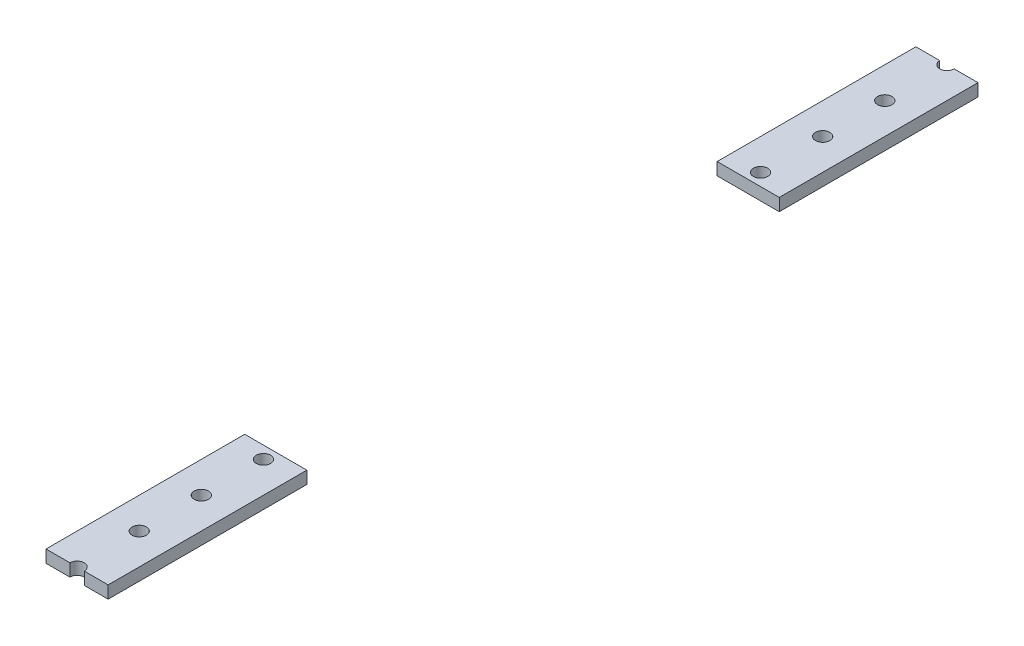
ISO-10303-21;
HEADER;
FILE_DESCRIPTION(('STEP AP214'),'2;1');
FILE_NAME('part.step','',(''),(''),'','','');
FILE_SCHEMA(('AUTOMOTIVE_DESIGN { 1 0 10303 214 1 1 1 1 }'));
ENDSEC;
DATA;
#1=APPLICATION_CONTEXT('core data for automotive mechanical design processes');
#2=APPLICATION_PROTOCOL_DEFINITION('international standard','automotive_design',2000,#1);
#3=PRODUCT_CONTEXT('',#1,'mechanical');
#4=PRODUCT('Part','Part','',(#3));
#5=PRODUCT_RELATED_PRODUCT_CATEGORY('part','',(#4));
#6=PRODUCT_DEFINITION_FORMATION('','',#4);
#7=PRODUCT_DEFINITION_CONTEXT('part definition',#1,'design');
#8=PRODUCT_DEFINITION('design','',#6,#7);
#9=PRODUCT_DEFINITION_SHAPE('','',#8);
#10=(LENGTH_UNIT() NAMED_UNIT(*) SI_UNIT(.MILLI.,.METRE.));
#11=(NAMED_UNIT(*) PLANE_ANGLE_UNIT() SI_UNIT($,.RADIAN.));
#12=(NAMED_UNIT(*) SI_UNIT($,.STERADIAN.) SOLID_ANGLE_UNIT());
#13=UNCERTAINTY_MEASURE_WITH_UNIT(LENGTH_MEASURE(1.E-05),#10,'distance_accuracy_value','');
#14=(GEOMETRIC_REPRESENTATION_CONTEXT(3) GLOBAL_UNCERTAINTY_ASSIGNED_CONTEXT((#13)) GLOBAL_UNIT_ASSIGNED_CONTEXT((#10,
#11,#12)) REPRESENTATION_CONTEXT('',''));
#15=CARTESIAN_POINT('',(0.,0.,0.));
#16=DIRECTION('',(0.,0.,1.));
#17=DIRECTION('',(1.,0.,0.));
#18=AXIS2_PLACEMENT_3D('',#15,#16,#17);
#19=CARTESIAN_POINT('',(-8.,0.,0.));
#20=DIRECTION('',(0.,-1.,0.));
#21=DIRECTION('',(0.,0.,-1.));
#22=AXIS2_PLACEMENT_3D('',#19,#20,#21);
#23=PLANE('',#22);
#24=DIRECTION('',(1.,0.,0.));
#25=VECTOR('',#24,1.);
#26=CARTESIAN_POINT('',(-8.,0.,-75.175));
#27=LINE('',#26,#25);
#28=CARTESIAN_POINT('',(-8.,0.,-75.175));
#29=VERTEX_POINT('',#28);
#30=CARTESIAN_POINT('',(8.,0.,-75.175));
#31=VERTEX_POINT('',#30);
#32=EDGE_CURVE('E93',#29,#31,#27,.T.);
#33=ORIENTED_EDGE('',*,*,#32,.T.);
#34=DIRECTION('',(0.,0.,-1.));
#35=VECTOR('',#34,1.);
#36=CARTESIAN_POINT('',(8.,0.,0.));
#37=LINE('',#36,#35);
#38=CARTESIAN_POINT('',(8.,0.,-24.));
#39=VERTEX_POINT('',#38);
#40=EDGE_CURVE('E98',#39,#31,#37,.T.);
#41=ORIENTED_EDGE('',*,*,#40,.F.);
#42=DIRECTION('',(-1.,0.,0.));
#43=VECTOR('',#42,1.);
#44=CARTESIAN_POINT('',(8.,0.,-24.));
#45=LINE('',#44,#43);
#46=CARTESIAN_POINT('',(1.85,0.,-24.));
#47=VERTEX_POINT('',#46);
#48=EDGE_CURVE('E107',#39,#47,#45,.T.);
#49=ORIENTED_EDGE('',*,*,#48,.T.);
#50=CARTESIAN_POINT('',(0.,0.,-24.));
#51=DIRECTION('',(0.,-1.,0.));
#52=DIRECTION('',(0.,0.,-1.));
#53=AXIS2_PLACEMENT_3D('',#50,#51,#52);
#54=CIRCLE('',#53,1.85);
#55=CARTESIAN_POINT('',(-1.85,0.,-24.));
#56=VERTEX_POINT('',#55);
#57=EDGE_CURVE('E122',#47,#56,#54,.F.);
#58=ORIENTED_EDGE('',*,*,#57,.T.);
#59=CARTESIAN_POINT('',(-7.99999999999999,0.,-24.));
#60=VERTEX_POINT('',#59);
#61=EDGE_CURVE('E123',#56,#60,#45,.T.);
#62=ORIENTED_EDGE('',*,*,#61,.T.);
#63=DIRECTION('',(0.,0.,1.));
#64=VECTOR('',#63,1.);
#65=CARTESIAN_POINT('',(-8.,0.,0.));
#66=LINE('',#65,#64);
#67=EDGE_CURVE('E47',#29,#60,#66,.T.);
#68=ORIENTED_EDGE('',*,*,#67,.F.);
#69=EDGE_LOOP('',(#33,#41,#49,#58,#62,#68));
#70=FACE_BOUND('',#69,.T.);
#71=CARTESIAN_POINT('',(0.,0.,-40.));
#72=DIRECTION('',(0.,-1.,0.));
#73=DIRECTION('',(0.,0.,-1.));
#74=AXIS2_PLACEMENT_3D('',#71,#72,#73);
#75=CIRCLE('',#74,1.85);
#76=CARTESIAN_POINT('',(0.,0.,-41.85));
#77=VERTEX_POINT('',#76);
#78=EDGE_CURVE('E151',#77,#77,#75,.F.);
#79=ORIENTED_EDGE('',*,*,#78,.T.);
#80=EDGE_LOOP('',(#79));
#81=FACE_BOUND('',#80,.T.);
#82=CARTESIAN_POINT('',(0.,0.,-56.));
#83=DIRECTION('',(0.,-1.,0.));
#84=DIRECTION('',(0.,0.,-1.));
#85=AXIS2_PLACEMENT_3D('',#82,#83,#84);
#86=CIRCLE('',#85,1.85);
#87=CARTESIAN_POINT('',(0.,0.,-57.85));
#88=VERTEX_POINT('',#87);
#89=EDGE_CURVE('E148',#88,#88,#86,.F.);
#90=ORIENTED_EDGE('',*,*,#89,.T.);
#91=EDGE_LOOP('',(#90));
#92=FACE_BOUND('',#91,.T.);
#93=CARTESIAN_POINT('',(0.,0.,-72.));
#94=DIRECTION('',(0.,-1.,0.));
#95=DIRECTION('',(0.,0.,-1.));
#96=AXIS2_PLACEMENT_3D('',#93,#94,#95);
#97=CIRCLE('',#96,1.85);
#98=CARTESIAN_POINT('',(0.,0.,-73.85));
#99=VERTEX_POINT('',#98);
#100=EDGE_CURVE('E145',#99,#99,#97,.F.);
#101=ORIENTED_EDGE('',*,*,#100,.T.);
#102=EDGE_LOOP('',(#101));
#103=FACE_BOUND('',#102,.T.);
#104=ADVANCED_FACE('F44',(#70,#81,#92,#103),#23,.T.);
#105=CARTESIAN_POINT('',(-8.,3.2,0.));
#106=DIRECTION('',(-1.,0.,0.));
#107=DIRECTION('',(0.,0.,1.));
#108=AXIS2_PLACEMENT_3D('',#105,#106,#107);
#109=PLANE('',#108);
#110=DIRECTION('',(0.,1.,0.));
#111=VECTOR('',#110,1.);
#112=CARTESIAN_POINT('',(-8.,0.,-75.175));
#113=LINE('',#112,#111);
#114=CARTESIAN_POINT('',(-8.,3.2,-75.175));
#115=VERTEX_POINT('',#114);
#116=EDGE_CURVE('E12',#29,#115,#113,.T.);
#117=ORIENTED_EDGE('',*,*,#116,.F.);
#118=ORIENTED_EDGE('',*,*,#67,.T.);
#119=DIRECTION('',(0.,1.,0.));
#120=VECTOR('',#119,1.);
#121=CARTESIAN_POINT('',(-7.99999999999999,0.,-24.));
#122=LINE('',#121,#120);
#123=CARTESIAN_POINT('',(-7.99999999999999,3.2,-24.));
#124=VERTEX_POINT('',#123);
#125=EDGE_CURVE('E99',#60,#124,#122,.T.);
#126=ORIENTED_EDGE('',*,*,#125,.T.);
#127=DIRECTION('',(0.,0.,1.));
#128=VECTOR('',#127,1.);
#129=CARTESIAN_POINT('',(-8.,3.2,0.));
#130=LINE('',#129,#128);
#131=EDGE_CURVE('E112',#115,#124,#130,.T.);
#132=ORIENTED_EDGE('',*,*,#131,.F.);
#133=EDGE_LOOP('',(#117,#118,#126,#132));
#134=FACE_BOUND('',#133,.T.);
#135=ADVANCED_FACE('F165',(#134),#109,.T.);
#136=CARTESIAN_POINT('',(8.,0.,0.));
#137=DIRECTION('',(1.,0.,0.));
#138=DIRECTION('',(0.,0.,-1.));
#139=AXIS2_PLACEMENT_3D('',#136,#137,#138);
#140=PLANE('',#139);
#141=DIRECTION('',(0.,1.,0.));
#142=VECTOR('',#141,1.);
#143=CARTESIAN_POINT('',(8.,0.,-75.175));
#144=LINE('',#143,#142);
#145=CARTESIAN_POINT('',(8.,3.2,-75.175));
#146=VERTEX_POINT('',#145);
#147=EDGE_CURVE('E90',#31,#146,#144,.T.);
#148=ORIENTED_EDGE('',*,*,#147,.T.);
#149=DIRECTION('',(0.,0.,1.));
#150=VECTOR('',#149,1.);
#151=CARTESIAN_POINT('',(8.,3.2,0.));
#152=LINE('',#151,#150);
#153=CARTESIAN_POINT('',(8.,3.2,-24.));
#154=VERTEX_POINT('',#153);
#155=EDGE_CURVE('E116',#154,#146,#152,.F.);
#156=ORIENTED_EDGE('',*,*,#155,.F.);
#157=DIRECTION('',(0.,1.,0.));
#158=VECTOR('',#157,1.);
#159=CARTESIAN_POINT('',(8.,0.,-24.));
#160=LINE('',#159,#158);
#161=EDGE_CURVE('E111',#39,#154,#160,.T.);
#162=ORIENTED_EDGE('',*,*,#161,.F.);
#163=ORIENTED_EDGE('',*,*,#40,.T.);
#164=EDGE_LOOP('',(#148,#156,#162,#163));
#165=FACE_BOUND('',#164,.T.);
#166=ADVANCED_FACE('F110',(#165),#140,.T.);
#167=CARTESIAN_POINT('',(8.,3.2,0.));
#168=DIRECTION('',(0.,1.,0.));
#169=DIRECTION('',(0.,0.,1.));
#170=AXIS2_PLACEMENT_3D('',#167,#168,#169);
#171=PLANE('',#170);
#172=DIRECTION('',(1.,0.,0.));
#173=VECTOR('',#172,1.);
#174=CARTESIAN_POINT('',(-8.,3.2,-75.175));
#175=LINE('',#174,#173);
#176=EDGE_CURVE('E53',#115,#146,#175,.T.);
#177=ORIENTED_EDGE('',*,*,#176,.F.);
#178=ORIENTED_EDGE('',*,*,#131,.T.);
#179=DIRECTION('',(-1.,0.,0.));
#180=VECTOR('',#179,1.);
#181=CARTESIAN_POINT('',(7.99999999999999,3.2,-24.));
#182=LINE('',#181,#180);
#183=CARTESIAN_POINT('',(-1.85,3.2,-24.));
#184=VERTEX_POINT('',#183);
#185=EDGE_CURVE('E128',#184,#124,#182,.T.);
#186=ORIENTED_EDGE('',*,*,#185,.F.);
#187=CARTESIAN_POINT('',(0.,3.2,-24.));
#188=DIRECTION('',(0.,-1.,0.));
#189=DIRECTION('',(0.,0.,-1.));
#190=AXIS2_PLACEMENT_3D('',#187,#188,#189);
#191=CIRCLE('',#190,1.85);
#192=CARTESIAN_POINT('',(1.85,3.2,-24.));
#193=VERTEX_POINT('',#192);
#194=EDGE_CURVE('E113',#184,#193,#191,.T.);
#195=ORIENTED_EDGE('',*,*,#194,.T.);
#196=DIRECTION('',(-1.,0.,0.));
#197=VECTOR('',#196,1.);
#198=CARTESIAN_POINT('',(8.,3.2,-24.));
#199=LINE('',#198,#197);
#200=EDGE_CURVE('E119',#154,#193,#199,.T.);
#201=ORIENTED_EDGE('',*,*,#200,.F.);
#202=ORIENTED_EDGE('',*,*,#155,.T.);
#203=EDGE_LOOP('',(#177,#178,#186,#195,#201,#202));
#204=FACE_BOUND('',#203,.T.);
#205=CARTESIAN_POINT('',(0.,3.2,-40.));
#206=DIRECTION('',(0.,-1.,0.));
#207=DIRECTION('',(0.,0.,-1.));
#208=AXIS2_PLACEMENT_3D('',#205,#206,#207);
#209=CIRCLE('',#208,1.85);
#210=CARTESIAN_POINT('',(0.,3.2,-41.85));
#211=VERTEX_POINT('',#210);
#212=EDGE_CURVE('E117',#211,#211,#209,.T.);
#213=ORIENTED_EDGE('',*,*,#212,.T.);
#214=EDGE_LOOP('',(#213));
#215=FACE_BOUND('',#214,.T.);
#216=CARTESIAN_POINT('',(0.,3.2,-56.));
#217=DIRECTION('',(0.,-1.,0.));
#218=DIRECTION('',(0.,0.,-1.));
#219=AXIS2_PLACEMENT_3D('',#216,#217,#218);
#220=CIRCLE('',#219,1.85);
#221=CARTESIAN_POINT('',(0.,3.2,-57.85));
#222=VERTEX_POINT('',#221);
#223=EDGE_CURVE('E138',#222,#222,#220,.T.);
#224=ORIENTED_EDGE('',*,*,#223,.T.);
#225=EDGE_LOOP('',(#224));
#226=FACE_BOUND('',#225,.T.);
#227=CARTESIAN_POINT('',(0.,3.2,-72.));
#228=DIRECTION('',(0.,-1.,0.));
#229=DIRECTION('',(0.,0.,-1.));
#230=AXIS2_PLACEMENT_3D('',#227,#228,#229);
#231=CIRCLE('',#230,1.85);
#232=CARTESIAN_POINT('',(0.,3.2,-73.85));
#233=VERTEX_POINT('',#232);
#234=EDGE_CURVE('E135',#233,#233,#231,.T.);
#235=ORIENTED_EDGE('',*,*,#234,.T.);
#236=EDGE_LOOP('',(#235));
#237=FACE_BOUND('',#236,.T.);
#238=ADVANCED_FACE('F166',(#204,#215,#226,#237),#171,.T.);
#239=CARTESIAN_POINT('',(0.,3.2,-24.));
#240=DIRECTION('',(0.,-1.,0.));
#241=DIRECTION('',(0.,0.,-1.));
#242=AXIS2_PLACEMENT_3D('',#239,#240,#241);
#243=CYLINDRICAL_SURFACE('',#242,1.85);
#244=ORIENTED_EDGE('',*,*,#57,.F.);
#245=DIRECTION('',(0.,-1.,0.));
#246=VECTOR('',#245,1.);
#247=CARTESIAN_POINT('',(1.85,3.2,-24.));
#248=LINE('',#247,#246);
#249=EDGE_CURVE('E132',#47,#193,#248,.F.);
#250=ORIENTED_EDGE('',*,*,#249,.T.);
#251=ORIENTED_EDGE('',*,*,#194,.F.);
#252=DIRECTION('',(0.,-1.,0.));
#253=VECTOR('',#252,1.);
#254=CARTESIAN_POINT('',(-1.85,3.2,-24.));
#255=LINE('',#254,#253);
#256=EDGE_CURVE('E129',#184,#56,#255,.T.);
#257=ORIENTED_EDGE('',*,*,#256,.T.);
#258=EDGE_LOOP('',(#244,#250,#251,#257));
#259=FACE_BOUND('',#258,.T.);
#260=ADVANCED_FACE('F173',(#259),#243,.F.);
#261=CARTESIAN_POINT('',(0.,3.2,-40.));
#262=DIRECTION('',(0.,-1.,0.));
#263=DIRECTION('',(0.,0.,-1.));
#264=AXIS2_PLACEMENT_3D('',#261,#262,#263);
#265=CYLINDRICAL_SURFACE('',#264,1.85);
#266=ORIENTED_EDGE('',*,*,#212,.F.);
#267=EDGE_LOOP('',(#266));
#268=FACE_BOUND('',#267,.T.);
#269=ORIENTED_EDGE('',*,*,#78,.F.);
#270=EDGE_LOOP('',(#269));
#271=FACE_BOUND('',#270,.T.);
#272=ADVANCED_FACE('F175',(#268,#271),#265,.F.);
#273=CARTESIAN_POINT('',(0.,3.2,-56.));
#274=DIRECTION('',(0.,-1.,0.));
#275=DIRECTION('',(0.,0.,-1.));
#276=AXIS2_PLACEMENT_3D('',#273,#274,#275);
#277=CYLINDRICAL_SURFACE('',#276,1.85);
#278=ORIENTED_EDGE('',*,*,#223,.F.);
#279=EDGE_LOOP('',(#278));
#280=FACE_BOUND('',#279,.T.);
#281=ORIENTED_EDGE('',*,*,#89,.F.);
#282=EDGE_LOOP('',(#281));
#283=FACE_BOUND('',#282,.T.);
#284=ADVANCED_FACE('F181',(#280,#283),#277,.F.);
#285=CARTESIAN_POINT('',(0.,3.2,-72.));
#286=DIRECTION('',(0.,-1.,0.));
#287=DIRECTION('',(0.,0.,-1.));
#288=AXIS2_PLACEMENT_3D('',#285,#286,#287);
#289=CYLINDRICAL_SURFACE('',#288,1.85);
#290=ORIENTED_EDGE('',*,*,#234,.F.);
#291=EDGE_LOOP('',(#290));
#292=FACE_BOUND('',#291,.T.);
#293=ORIENTED_EDGE('',*,*,#100,.F.);
#294=EDGE_LOOP('',(#293));
#295=FACE_BOUND('',#294,.T.);
#296=ADVANCED_FACE('F185',(#292,#295),#289,.F.);
#297=CARTESIAN_POINT('',(8.,0.,-24.));
#298=DIRECTION('',(0.,0.,-1.));
#299=DIRECTION('',(-1.,0.,0.));
#300=AXIS2_PLACEMENT_3D('',#297,#298,#299);
#301=PLANE('',#300);
#302=ORIENTED_EDGE('',*,*,#185,.T.);
#303=ORIENTED_EDGE('',*,*,#125,.F.);
#304=ORIENTED_EDGE('',*,*,#61,.F.);
#305=ORIENTED_EDGE('',*,*,#256,.F.);
#306=EDGE_LOOP('',(#302,#303,#304,#305));
#307=FACE_BOUND('',#306,.T.);
#308=ADVANCED_FACE('F160',(#307),#301,.F.);
#309=ORIENTED_EDGE('',*,*,#48,.F.);
#310=ORIENTED_EDGE('',*,*,#161,.T.);
#311=ORIENTED_EDGE('',*,*,#200,.T.);
#312=ORIENTED_EDGE('',*,*,#249,.F.);
#313=EDGE_LOOP('',(#309,#310,#311,#312));
#314=FACE_BOUND('',#313,.T.);
#315=ADVANCED_FACE('F170',(#314),#301,.F.);
#316=CARTESIAN_POINT('',(-8.,0.,-75.175));
#317=DIRECTION('',(0.,0.,1.));
#318=DIRECTION('',(1.,0.,0.));
#319=AXIS2_PLACEMENT_3D('',#316,#317,#318);
#320=PLANE('',#319);
#321=ORIENTED_EDGE('',*,*,#176,.T.);
#322=ORIENTED_EDGE('',*,*,#147,.F.);
#323=ORIENTED_EDGE('',*,*,#32,.F.);
#324=ORIENTED_EDGE('',*,*,#116,.T.);
#325=EDGE_LOOP('',(#321,#322,#323,#324));
#326=FACE_BOUND('',#325,.T.);
#327=ADVANCED_FACE('F92',(#326),#320,.F.);
#328=CLOSED_SHELL('',(#104,#135,#166,#238,#260,#272,#284,#296,#308,#315,#327));
#329=MANIFOLD_SOLID_BREP('B2',#328);
#330=CARTESIAN_POINT('',(0.,3.2,-200.));
#331=DIRECTION('',(0.,-1.,0.));
#332=DIRECTION('',(0.,0.,-1.));
#333=AXIS2_PLACEMENT_3D('',#330,#331,#332);
#334=CYLINDRICAL_SURFACE('',#333,1.85);
#335=CARTESIAN_POINT('',(0.,3.2,-200.));
#336=DIRECTION('',(0.,-1.,0.));
#337=DIRECTION('',(0.,0.,-1.));
#338=AXIS2_PLACEMENT_3D('',#335,#336,#337);
#339=CIRCLE('',#338,1.85);
#340=CARTESIAN_POINT('',(0.,3.2,-201.85));
#341=VERTEX_POINT('',#340);
#342=EDGE_CURVE('E385',#341,#341,#339,.T.);
#343=ORIENTED_EDGE('',*,*,#342,.F.);
#344=EDGE_LOOP('',(#343));
#345=FACE_BOUND('',#344,.T.);
#346=CARTESIAN_POINT('',(0.,0.,-200.));
#347=DIRECTION('',(0.,-1.,0.));
#348=DIRECTION('',(0.,0.,-1.));
#349=AXIS2_PLACEMENT_3D('',#346,#347,#348);
#350=CIRCLE('',#349,1.85);
#351=CARTESIAN_POINT('',(0.,0.,-201.85));
#352=VERTEX_POINT('',#351);
#353=EDGE_CURVE('E366',#352,#352,#350,.F.);
#354=ORIENTED_EDGE('',*,*,#353,.F.);
#355=EDGE_LOOP('',(#354));
#356=FACE_BOUND('',#355,.T.);
#357=ADVANCED_FACE('F293',(#345,#356),#334,.F.);
#358=CARTESIAN_POINT('',(0.,3.2,-216.));
#359=DIRECTION('',(0.,-1.,0.));
#360=DIRECTION('',(0.,0.,-1.));
#361=AXIS2_PLACEMENT_3D('',#358,#359,#360);
#362=CYLINDRICAL_SURFACE('',#361,1.85);
#363=CARTESIAN_POINT('',(0.,3.2,-216.));
#364=DIRECTION('',(0.,-1.,0.));
#365=DIRECTION('',(0.,0.,-1.));
#366=AXIS2_PLACEMENT_3D('',#363,#364,#365);
#367=CIRCLE('',#366,1.85);
#368=CARTESIAN_POINT('',(0.,3.2,-217.85));
#369=VERTEX_POINT('',#368);
#370=EDGE_CURVE('E382',#369,#369,#367,.T.);
#371=ORIENTED_EDGE('',*,*,#370,.F.);
#372=EDGE_LOOP('',(#371));
#373=FACE_BOUND('',#372,.T.);
#374=CARTESIAN_POINT('',(0.,0.,-216.));
#375=DIRECTION('',(0.,-1.,0.));
#376=DIRECTION('',(0.,0.,-1.));
#377=AXIS2_PLACEMENT_3D('',#374,#375,#376);
#378=CIRCLE('',#377,1.85);
#379=CARTESIAN_POINT('',(0.,0.,-217.85));
#380=VERTEX_POINT('',#379);
#381=EDGE_CURVE('E370',#380,#380,#378,.F.);
#382=ORIENTED_EDGE('',*,*,#381,.F.);
#383=EDGE_LOOP('',(#382));
#384=FACE_BOUND('',#383,.T.);
#385=ADVANCED_FACE('F398',(#373,#384),#362,.F.);
#386=CARTESIAN_POINT('',(0.,3.2,-232.));
#387=DIRECTION('',(0.,-1.,0.));
#388=DIRECTION('',(0.,0.,-1.));
#389=AXIS2_PLACEMENT_3D('',#386,#387,#388);
#390=CYLINDRICAL_SURFACE('',#389,1.85);
#391=CARTESIAN_POINT('',(0.,3.2,-232.));
#392=DIRECTION('',(0.,-1.,0.));
#393=DIRECTION('',(0.,0.,-1.));
#394=AXIS2_PLACEMENT_3D('',#391,#392,#393);
#395=CIRCLE('',#394,1.85);
#396=CARTESIAN_POINT('',(0.,3.2,-233.85));
#397=VERTEX_POINT('',#396);
#398=EDGE_CURVE('E379',#397,#397,#395,.T.);
#399=ORIENTED_EDGE('',*,*,#398,.F.);
#400=EDGE_LOOP('',(#399));
#401=FACE_BOUND('',#400,.T.);
#402=CARTESIAN_POINT('',(0.,0.,-232.));
#403=DIRECTION('',(0.,-1.,0.));
#404=DIRECTION('',(0.,0.,-1.));
#405=AXIS2_PLACEMENT_3D('',#402,#403,#404);
#406=CIRCLE('',#405,1.85);
#407=CARTESIAN_POINT('',(0.,0.,-233.85));
#408=VERTEX_POINT('',#407);
#409=EDGE_CURVE('E390',#408,#408,#406,.F.);
#410=ORIENTED_EDGE('',*,*,#409,.F.);
#411=EDGE_LOOP('',(#410));
#412=FACE_BOUND('',#411,.T.);
#413=ADVANCED_FACE('F400',(#401,#412),#390,.F.);
#414=CARTESIAN_POINT('',(-8.,0.,-248.));
#415=DIRECTION('',(0.,0.,1.));
#416=DIRECTION('',(1.,0.,0.));
#417=AXIS2_PLACEMENT_3D('',#414,#415,#416);
#418=PLANE('',#417);
#419=DIRECTION('',(1.,0.,0.));
#420=VECTOR('',#419,1.);
#421=CARTESIAN_POINT('',(-8.,0.,-248.));
#422=LINE('',#421,#420);
#423=CARTESIAN_POINT('',(-8.,0.,-248.));
#424=VERTEX_POINT('',#423);
#425=CARTESIAN_POINT('',(-1.85,0.,-248.));
#426=VERTEX_POINT('',#425);
#427=EDGE_CURVE('E438',#424,#426,#422,.T.);
#428=ORIENTED_EDGE('',*,*,#427,.F.);
#429=DIRECTION('',(0.,1.,0.));
#430=VECTOR('',#429,1.);
#431=CARTESIAN_POINT('',(-8.,0.,-248.));
#432=LINE('',#431,#430);
#433=CARTESIAN_POINT('',(-8.,3.2,-248.));
#434=VERTEX_POINT('',#433);
#435=EDGE_CURVE('E316',#424,#434,#432,.T.);
#436=ORIENTED_EDGE('',*,*,#435,.T.);
#437=DIRECTION('',(1.,0.,0.));
#438=VECTOR('',#437,1.);
#439=CARTESIAN_POINT('',(-8.,3.2,-248.));
#440=LINE('',#439,#438);
#441=CARTESIAN_POINT('',(-1.85,3.2,-248.));
#442=VERTEX_POINT('',#441);
#443=EDGE_CURVE('E425',#434,#442,#440,.T.);
#444=ORIENTED_EDGE('',*,*,#443,.T.);
#445=DIRECTION('',(0.,-1.,0.));
#446=VECTOR('',#445,1.);
#447=CARTESIAN_POINT('',(-1.85,3.2,-248.));
#448=LINE('',#447,#446);
#449=EDGE_CURVE('E371',#426,#442,#448,.F.);
#450=ORIENTED_EDGE('',*,*,#449,.F.);
#451=EDGE_LOOP('',(#428,#436,#444,#450));
#452=FACE_BOUND('',#451,.T.);
#453=ADVANCED_FACE('F407',(#452),#418,.F.);
#454=CARTESIAN_POINT('',(0.,3.2,-248.));
#455=DIRECTION('',(0.,-1.,0.));
#456=DIRECTION('',(0.,0.,-1.));
#457=AXIS2_PLACEMENT_3D('',#454,#455,#456);
#458=CYLINDRICAL_SURFACE('',#457,1.85);
#459=CARTESIAN_POINT('',(0.,0.,-248.));
#460=DIRECTION('',(0.,-1.,0.));
#461=DIRECTION('',(0.,0.,-1.));
#462=AXIS2_PLACEMENT_3D('',#459,#460,#461);
#463=CIRCLE('',#462,1.85);
#464=CARTESIAN_POINT('',(1.85,0.,-248.));
#465=VERTEX_POINT('',#464);
#466=EDGE_CURVE('E388',#426,#465,#463,.F.);
#467=ORIENTED_EDGE('',*,*,#466,.F.);
#468=ORIENTED_EDGE('',*,*,#449,.T.);
#469=CARTESIAN_POINT('',(0.,3.2,-248.));
#470=DIRECTION('',(0.,-1.,0.));
#471=DIRECTION('',(0.,0.,-1.));
#472=AXIS2_PLACEMENT_3D('',#469,#470,#471);
#473=CIRCLE('',#472,1.85);
#474=CARTESIAN_POINT('',(1.85,3.2,-248.));
#475=VERTEX_POINT('',#474);
#476=EDGE_CURVE('E301',#475,#442,#473,.T.);
#477=ORIENTED_EDGE('',*,*,#476,.F.);
#478=DIRECTION('',(0.,-1.,0.));
#479=VECTOR('',#478,1.);
#480=CARTESIAN_POINT('',(1.85,3.2,-248.));
#481=LINE('',#480,#479);
#482=EDGE_CURVE('E433',#475,#465,#481,.T.);
#483=ORIENTED_EDGE('',*,*,#482,.T.);
#484=EDGE_LOOP('',(#467,#468,#477,#483));
#485=FACE_BOUND('',#484,.T.);
#486=ADVANCED_FACE('F445',(#485),#458,.F.);
#487=DIRECTION('',(1.,0.,0.));
#488=VECTOR('',#487,1.);
#489=CARTESIAN_POINT('',(8.,3.2,-248.));
#490=LINE('',#489,#488);
#491=CARTESIAN_POINT('',(8.00000000000001,3.2,-248.));
#492=VERTEX_POINT('',#491);
#493=EDGE_CURVE('E42',#475,#492,#490,.T.);
#494=ORIENTED_EDGE('',*,*,#493,.T.);
#495=DIRECTION('',(0.,1.,0.));
#496=VECTOR('',#495,1.);
#497=CARTESIAN_POINT('',(8.00000000000001,0.,-248.));
#498=LINE('',#497,#496);
#499=CARTESIAN_POINT('',(8.00000000000001,0.,-248.));
#500=VERTEX_POINT('',#499);
#501=EDGE_CURVE('E436',#500,#492,#498,.T.);
#502=ORIENTED_EDGE('',*,*,#501,.F.);
#503=EDGE_CURVE('E365',#465,#500,#422,.T.);
#504=ORIENTED_EDGE('',*,*,#503,.F.);
#505=ORIENTED_EDGE('',*,*,#482,.F.);
#506=EDGE_LOOP('',(#494,#502,#504,#505));
#507=FACE_BOUND('',#506,.T.);
#508=ADVANCED_FACE('F448',(#507),#418,.F.);
#509=CARTESIAN_POINT('',(8.,3.2,0.));
#510=DIRECTION('',(0.,1.,0.));
#511=DIRECTION('',(0.,0.,1.));
#512=AXIS2_PLACEMENT_3D('',#509,#510,#511);
#513=PLANE('',#512);
#514=DIRECTION('',(-1.,0.,0.));
#515=VECTOR('',#514,1.);
#516=CARTESIAN_POINT('',(-8.,3.2,-196.825));
#517=LINE('',#516,#515);
#518=CARTESIAN_POINT('',(8.,3.2,-196.825));
#519=VERTEX_POINT('',#518);
#520=CARTESIAN_POINT('',(-8.,3.2,-196.825));
#521=VERTEX_POINT('',#520);
#522=EDGE_CURVE('E352',#519,#521,#517,.T.);
#523=ORIENTED_EDGE('',*,*,#522,.F.);
#524=DIRECTION('',(0.,0.,1.));
#525=VECTOR('',#524,1.);
#526=CARTESIAN_POINT('',(8.,3.2,0.));
#527=LINE('',#526,#525);
#528=EDGE_CURVE('E360',#519,#492,#527,.F.);
#529=ORIENTED_EDGE('',*,*,#528,.T.);
#530=ORIENTED_EDGE('',*,*,#493,.F.);
#531=ORIENTED_EDGE('',*,*,#476,.T.);
#532=ORIENTED_EDGE('',*,*,#443,.F.);
#533=DIRECTION('',(0.,0.,1.));
#534=VECTOR('',#533,1.);
#535=CARTESIAN_POINT('',(-8.,3.2,0.));
#536=LINE('',#535,#534);
#537=EDGE_CURVE('E374',#434,#521,#536,.T.);
#538=ORIENTED_EDGE('',*,*,#537,.T.);
#539=EDGE_LOOP('',(#523,#529,#530,#531,#532,#538));
#540=FACE_BOUND('',#539,.T.);
#541=ORIENTED_EDGE('',*,*,#398,.T.);
#542=EDGE_LOOP('',(#541));
#543=FACE_BOUND('',#542,.T.);
#544=ORIENTED_EDGE('',*,*,#370,.T.);
#545=EDGE_LOOP('',(#544));
#546=FACE_BOUND('',#545,.T.);
#547=ORIENTED_EDGE('',*,*,#342,.T.);
#548=EDGE_LOOP('',(#547));
#549=FACE_BOUND('',#548,.T.);
#550=ADVANCED_FACE('F417',(#540,#543,#546,#549),#513,.T.);
#551=CARTESIAN_POINT('',(8.,0.,0.));
#552=DIRECTION('',(1.,0.,0.));
#553=DIRECTION('',(0.,0.,-1.));
#554=AXIS2_PLACEMENT_3D('',#551,#552,#553);
#555=PLANE('',#554);
#556=DIRECTION('',(0.,1.,0.));
#557=VECTOR('',#556,1.);
#558=CARTESIAN_POINT('',(8.,0.,-196.825));
#559=LINE('',#558,#557);
#560=CARTESIAN_POINT('',(8.,0.,-196.825));
#561=VERTEX_POINT('',#560);
#562=EDGE_CURVE('E308',#561,#519,#559,.T.);
#563=ORIENTED_EDGE('',*,*,#562,.F.);
#564=DIRECTION('',(0.,0.,-1.));
#565=VECTOR('',#564,1.);
#566=CARTESIAN_POINT('',(8.,0.,0.));
#567=LINE('',#566,#565);
#568=EDGE_CURVE('E358',#561,#500,#567,.T.);
#569=ORIENTED_EDGE('',*,*,#568,.T.);
#570=ORIENTED_EDGE('',*,*,#501,.T.);
#571=ORIENTED_EDGE('',*,*,#528,.F.);
#572=EDGE_LOOP('',(#563,#569,#570,#571));
#573=FACE_BOUND('',#572,.T.);
#574=ADVANCED_FACE('F356',(#573),#555,.T.);
#575=CARTESIAN_POINT('',(-8.,3.2,0.));
#576=DIRECTION('',(-1.,0.,0.));
#577=DIRECTION('',(0.,0.,1.));
#578=AXIS2_PLACEMENT_3D('',#575,#576,#577);
#579=PLANE('',#578);
#580=DIRECTION('',(0.,1.,0.));
#581=VECTOR('',#580,1.);
#582=CARTESIAN_POINT('',(-8.,0.,-196.825));
#583=LINE('',#582,#581);
#584=CARTESIAN_POINT('',(-8.,0.,-196.825));
#585=VERTEX_POINT('',#584);
#586=EDGE_CURVE('E347',#585,#521,#583,.T.);
#587=ORIENTED_EDGE('',*,*,#586,.T.);
#588=ORIENTED_EDGE('',*,*,#537,.F.);
#589=ORIENTED_EDGE('',*,*,#435,.F.);
#590=DIRECTION('',(0.,0.,1.));
#591=VECTOR('',#590,1.);
#592=CARTESIAN_POINT('',(-8.,0.,0.));
#593=LINE('',#592,#591);
#594=EDGE_CURVE('E367',#424,#585,#593,.T.);
#595=ORIENTED_EDGE('',*,*,#594,.T.);
#596=EDGE_LOOP('',(#587,#588,#589,#595));
#597=FACE_BOUND('',#596,.T.);
#598=ADVANCED_FACE('F416',(#597),#579,.T.);
#599=CARTESIAN_POINT('',(-8.,0.,0.));
#600=DIRECTION('',(0.,-1.,0.));
#601=DIRECTION('',(0.,0.,-1.));
#602=AXIS2_PLACEMENT_3D('',#599,#600,#601);
#603=PLANE('',#602);
#604=DIRECTION('',(-1.,0.,0.));
#605=VECTOR('',#604,1.);
#606=CARTESIAN_POINT('',(-8.,0.,-196.825));
#607=LINE('',#606,#605);
#608=EDGE_CURVE('E344',#561,#585,#607,.T.);
#609=ORIENTED_EDGE('',*,*,#608,.T.);
#610=ORIENTED_EDGE('',*,*,#594,.F.);
#611=ORIENTED_EDGE('',*,*,#427,.T.);
#612=ORIENTED_EDGE('',*,*,#466,.T.);
#613=ORIENTED_EDGE('',*,*,#503,.T.);
#614=ORIENTED_EDGE('',*,*,#568,.F.);
#615=EDGE_LOOP('',(#609,#610,#611,#612,#613,#614));
#616=FACE_BOUND('',#615,.T.);
#617=ORIENTED_EDGE('',*,*,#409,.T.);
#618=EDGE_LOOP('',(#617));
#619=FACE_BOUND('',#618,.T.);
#620=ORIENTED_EDGE('',*,*,#381,.T.);
#621=EDGE_LOOP('',(#620));
#622=FACE_BOUND('',#621,.T.);
#623=ORIENTED_EDGE('',*,*,#353,.T.);
#624=EDGE_LOOP('',(#623));
#625=FACE_BOUND('',#624,.T.);
#626=ADVANCED_FACE('F295',(#616,#619,#622,#625),#603,.T.);
#627=CARTESIAN_POINT('',(-8.,0.,-196.825));
#628=DIRECTION('',(0.,0.,-1.));
#629=DIRECTION('',(-1.,0.,0.));
#630=AXIS2_PLACEMENT_3D('',#627,#628,#629);
#631=PLANE('',#630);
#632=ORIENTED_EDGE('',*,*,#522,.T.);
#633=ORIENTED_EDGE('',*,*,#586,.F.);
#634=ORIENTED_EDGE('',*,*,#608,.F.);
#635=ORIENTED_EDGE('',*,*,#562,.T.);
#636=EDGE_LOOP('',(#632,#633,#634,#635));
#637=FACE_BOUND('',#636,.T.);
#638=ADVANCED_FACE('F345',(#637),#631,.F.);
#639=CLOSED_SHELL('',(#357,#385,#413,#453,#486,#508,#550,#574,#598,#626,#638));
#640=MANIFOLD_SOLID_BREP('B6',#639);
#641=ADVANCED_BREP_SHAPE_REPRESENTATION('',(#18,#329,#640),#14);
#642=SHAPE_DEFINITION_REPRESENTATION(#9,#641);
ENDSEC;
END-ISO-10303-21;
